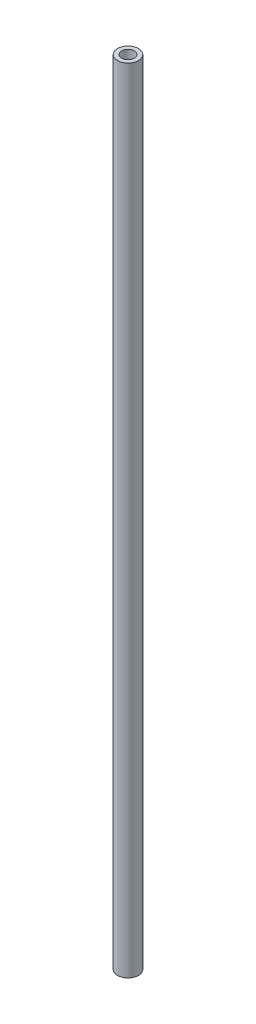
ISO-10303-21;
HEADER;
FILE_DESCRIPTION(('STEP AP214'),'2;1');
FILE_NAME('part.step','',(''),(''),'','','');
FILE_SCHEMA(('AUTOMOTIVE_DESIGN { 1 0 10303 214 1 1 1 1 }'));
ENDSEC;
DATA;
#1=APPLICATION_CONTEXT('core data for automotive mechanical design processes');
#2=APPLICATION_PROTOCOL_DEFINITION('international standard','automotive_design',2000,#1);
#3=PRODUCT_CONTEXT('',#1,'mechanical');
#4=PRODUCT('Part','Part','',(#3));
#5=PRODUCT_RELATED_PRODUCT_CATEGORY('part','',(#4));
#6=PRODUCT_DEFINITION_FORMATION('','',#4);
#7=PRODUCT_DEFINITION_CONTEXT('part definition',#1,'design');
#8=PRODUCT_DEFINITION('design','',#6,#7);
#9=PRODUCT_DEFINITION_SHAPE('','',#8);
#10=(LENGTH_UNIT() NAMED_UNIT(*) SI_UNIT(.MILLI.,.METRE.));
#11=(NAMED_UNIT(*) PLANE_ANGLE_UNIT() SI_UNIT($,.RADIAN.));
#12=(NAMED_UNIT(*) SI_UNIT($,.STERADIAN.) SOLID_ANGLE_UNIT());
#13=UNCERTAINTY_MEASURE_WITH_UNIT(LENGTH_MEASURE(1.E-05),#10,'distance_accuracy_value','');
#14=(GEOMETRIC_REPRESENTATION_CONTEXT(3) GLOBAL_UNCERTAINTY_ASSIGNED_CONTEXT((#13)) GLOBAL_UNIT_ASSIGNED_CONTEXT((#10,
#11,#12)) REPRESENTATION_CONTEXT('',''));
#15=CARTESIAN_POINT('',(0.,0.,0.));
#16=DIRECTION('',(0.,0.,1.));
#17=DIRECTION('',(1.,0.,0.));
#18=AXIS2_PLACEMENT_3D('',#15,#16,#17);
#19=CARTESIAN_POINT('',(0.,304.8,0.));
#20=DIRECTION('',(0.,1.,0.));
#21=DIRECTION('',(0.,0.,1.));
#22=AXIS2_PLACEMENT_3D('',#19,#20,#21);
#23=PLANE('',#22);
#24=CARTESIAN_POINT('',(0.,304.8,0.));
#25=DIRECTION('',(0.,1.,0.));
#26=DIRECTION('',(0.,0.,1.));
#27=AXIS2_PLACEMENT_3D('',#24,#25,#26);
#28=CIRCLE('',#27,4.0259);
#29=CARTESIAN_POINT('',(0.,304.8,4.0259));
#30=VERTEX_POINT('',#29);
#31=EDGE_CURVE('E10',#30,#30,#28,.T.);
#32=ORIENTED_EDGE('',*,*,#31,.T.);
#33=EDGE_LOOP('',(#32));
#34=FACE_BOUND('',#33,.T.);
#35=CARTESIAN_POINT('',(0.,304.8,0.));
#36=DIRECTION('',(0.,1.,0.));
#37=DIRECTION('',(0.,0.,1.));
#38=AXIS2_PLACEMENT_3D('',#35,#36,#37);
#39=CIRCLE('',#38,2.4384);
#40=CARTESIAN_POINT('',(0.,304.8,2.4384));
#41=VERTEX_POINT('',#40);
#42=EDGE_CURVE('E47',#41,#41,#39,.T.);
#43=ORIENTED_EDGE('',*,*,#42,.F.);
#44=EDGE_LOOP('',(#43));
#45=FACE_BOUND('',#44,.T.);
#46=ADVANCED_FACE('F36',(#34,#45),#23,.T.);
#47=CARTESIAN_POINT('',(0.,0.,0.));
#48=DIRECTION('',(0.,1.,0.));
#49=DIRECTION('',(0.,0.,1.));
#50=AXIS2_PLACEMENT_3D('',#47,#48,#49);
#51=PLANE('',#50);
#52=CARTESIAN_POINT('',(0.,0.,0.));
#53=DIRECTION('',(0.,1.,0.));
#54=DIRECTION('',(0.,0.,1.));
#55=AXIS2_PLACEMENT_3D('',#52,#53,#54);
#56=CIRCLE('',#55,4.0259);
#57=CARTESIAN_POINT('',(0.,0.,4.0259));
#58=VERTEX_POINT('',#57);
#59=EDGE_CURVE('E40',#58,#58,#56,.T.);
#60=ORIENTED_EDGE('',*,*,#59,.F.);
#61=EDGE_LOOP('',(#60));
#62=FACE_BOUND('',#61,.T.);
#63=CARTESIAN_POINT('',(0.,0.,0.));
#64=DIRECTION('',(0.,1.,0.));
#65=DIRECTION('',(0.,0.,1.));
#66=AXIS2_PLACEMENT_3D('',#63,#64,#65);
#67=CIRCLE('',#66,2.4384);
#68=CARTESIAN_POINT('',(0.,0.,2.4384));
#69=VERTEX_POINT('',#68);
#70=EDGE_CURVE('E49',#69,#69,#67,.T.);
#71=ORIENTED_EDGE('',*,*,#70,.T.);
#72=EDGE_LOOP('',(#71));
#73=FACE_BOUND('',#72,.T.);
#74=ADVANCED_FACE('F59',(#62,#73),#51,.F.);
#75=CARTESIAN_POINT('',(0.,304.8,0.));
#76=DIRECTION('',(0.,-1.,0.));
#77=DIRECTION('',(0.,0.,-1.));
#78=AXIS2_PLACEMENT_3D('',#75,#76,#77);
#79=CYLINDRICAL_SURFACE('',#78,4.0259);
#80=ORIENTED_EDGE('',*,*,#31,.F.);
#81=EDGE_LOOP('',(#80));
#82=FACE_BOUND('',#81,.T.);
#83=ORIENTED_EDGE('',*,*,#59,.T.);
#84=EDGE_LOOP('',(#83));
#85=FACE_BOUND('',#84,.T.);
#86=ADVANCED_FACE('F38',(#82,#85),#79,.T.);
#87=CARTESIAN_POINT('',(0.,304.8,0.));
#88=DIRECTION('',(0.,-1.,0.));
#89=DIRECTION('',(0.,0.,-1.));
#90=AXIS2_PLACEMENT_3D('',#87,#88,#89);
#91=CYLINDRICAL_SURFACE('',#90,2.4384);
#92=ORIENTED_EDGE('',*,*,#42,.T.);
#93=EDGE_LOOP('',(#92));
#94=FACE_BOUND('',#93,.T.);
#95=ORIENTED_EDGE('',*,*,#70,.F.);
#96=EDGE_LOOP('',(#95));
#97=FACE_BOUND('',#96,.T.);
#98=ADVANCED_FACE('F55',(#94,#97),#91,.F.);
#99=CLOSED_SHELL('',(#46,#74,#86,#98));
#100=MANIFOLD_SOLID_BREP('B2',#99);
#101=ADVANCED_BREP_SHAPE_REPRESENTATION('',(#18,#100),#14);
#102=SHAPE_DEFINITION_REPRESENTATION(#9,#101);
ENDSEC;
END-ISO-10303-21;
